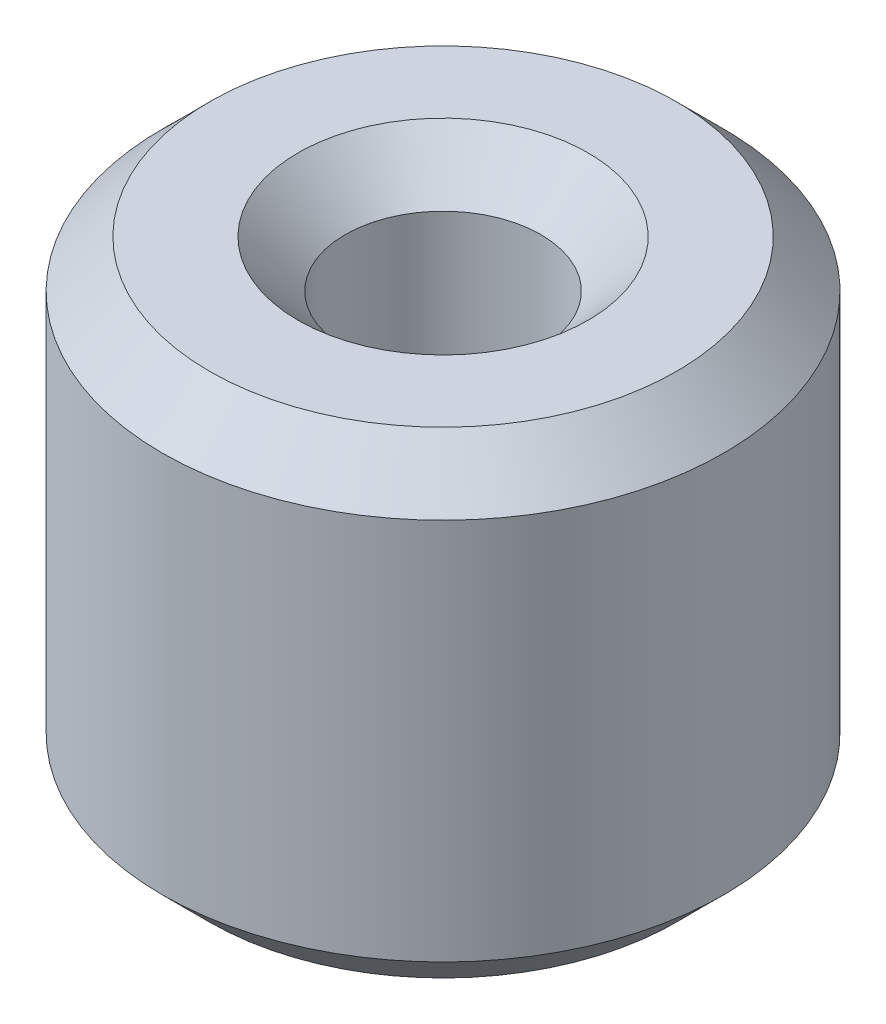
ISO-10303-21;
HEADER;
FILE_DESCRIPTION(('STEP AP214'),'2;1');
FILE_NAME('part.step','',(''),(''),'','','');
FILE_SCHEMA(('AUTOMOTIVE_DESIGN { 1 0 10303 214 1 1 1 1 }'));
ENDSEC;
DATA;
#1=APPLICATION_CONTEXT('core data for automotive mechanical design processes');
#2=APPLICATION_PROTOCOL_DEFINITION('international standard','automotive_design',2000,#1);
#3=PRODUCT_CONTEXT('',#1,'mechanical');
#4=PRODUCT('Part','Part','',(#3));
#5=PRODUCT_RELATED_PRODUCT_CATEGORY('part','',(#4));
#6=PRODUCT_DEFINITION_FORMATION('','',#4);
#7=PRODUCT_DEFINITION_CONTEXT('part definition',#1,'design');
#8=PRODUCT_DEFINITION('design','',#6,#7);
#9=PRODUCT_DEFINITION_SHAPE('','',#8);
#10=(LENGTH_UNIT() NAMED_UNIT(*) SI_UNIT(.MILLI.,.METRE.));
#11=(NAMED_UNIT(*) PLANE_ANGLE_UNIT() SI_UNIT($,.RADIAN.));
#12=(NAMED_UNIT(*) SI_UNIT($,.STERADIAN.) SOLID_ANGLE_UNIT());
#13=UNCERTAINTY_MEASURE_WITH_UNIT(LENGTH_MEASURE(1.E-05),#10,'distance_accuracy_value','');
#14=(GEOMETRIC_REPRESENTATION_CONTEXT(3) GLOBAL_UNCERTAINTY_ASSIGNED_CONTEXT((#13)) GLOBAL_UNIT_ASSIGNED_CONTEXT((#10,
#11,#12)) REPRESENTATION_CONTEXT('',''));
#15=CARTESIAN_POINT('',(0.,0.,0.));
#16=DIRECTION('',(0.,0.,1.));
#17=DIRECTION('',(1.,0.,0.));
#18=AXIS2_PLACEMENT_3D('',#15,#16,#17);
#19=CARTESIAN_POINT('',(0.,21.2412587301982,0.));
#20=DIRECTION('',(0.,-1.,0.));
#21=DIRECTION('',(0.,0.,-1.));
#22=AXIS2_PLACEMENT_3D('',#19,#20,#21);
#23=CYLINDRICAL_SURFACE('',#22,12.5);
#24=CARTESIAN_POINT('',(0.,2.10189315490494,0.));
#25=DIRECTION('',(0.,1.,0.));
#26=DIRECTION('',(0.,0.,1.));
#27=AXIS2_PLACEMENT_3D('',#24,#25,#26);
#28=CIRCLE('',#27,12.5);
#29=CARTESIAN_POINT('',(0.,2.10189315490494,12.5));
#30=VERTEX_POINT('',#29);
#31=EDGE_CURVE('E10',#30,#30,#28,.T.);
#32=ORIENTED_EDGE('',*,*,#31,.T.);
#33=EDGE_LOOP('',(#32));
#34=FACE_BOUND('',#33,.T.);
#35=CARTESIAN_POINT('',(0.,19.1393655752932,0.));
#36=DIRECTION('',(0.,1.,0.));
#37=DIRECTION('',(0.,0.,1.));
#38=AXIS2_PLACEMENT_3D('',#35,#36,#37);
#39=CIRCLE('',#38,12.5);
#40=CARTESIAN_POINT('',(0.,19.1393655752932,12.5));
#41=VERTEX_POINT('',#40);
#42=EDGE_CURVE('E50',#41,#41,#39,.F.);
#43=ORIENTED_EDGE('',*,*,#42,.T.);
#44=EDGE_LOOP('',(#43));
#45=FACE_BOUND('',#44,.T.);
#46=ADVANCED_FACE('F39',(#34,#45),#23,.T.);
#47=CARTESIAN_POINT('',(0.,21.2412587301982,0.));
#48=DIRECTION('',(0.,1.,0.));
#49=DIRECTION('',(0.,0.,1.));
#50=AXIS2_PLACEMENT_3D('',#47,#48,#49);
#51=PLANE('',#50);
#52=CARTESIAN_POINT('',(0.,21.2412587301982,0.));
#53=DIRECTION('',(0.,1.,0.));
#54=DIRECTION('',(0.,0.,1.));
#55=AXIS2_PLACEMENT_3D('',#52,#53,#54);
#56=CIRCLE('',#55,6.45964576572623);
#57=CARTESIAN_POINT('',(0.,21.2412587301982,6.45964576572623));
#58=VERTEX_POINT('',#57);
#59=EDGE_CURVE('E58',#58,#58,#56,.F.);
#60=ORIENTED_EDGE('',*,*,#59,.T.);
#61=EDGE_LOOP('',(#60));
#62=FACE_BOUND('',#61,.T.);
#63=CARTESIAN_POINT('',(0.,21.2412587301982,0.));
#64=DIRECTION('',(0.,1.,0.));
#65=DIRECTION('',(0.,0.,1.));
#66=AXIS2_PLACEMENT_3D('',#63,#64,#65);
#67=CIRCLE('',#66,10.3981068450951);
#68=CARTESIAN_POINT('',(0.,21.2412587301982,10.3981068450951));
#69=VERTEX_POINT('',#68);
#70=EDGE_CURVE('E61',#69,#69,#67,.T.);
#71=ORIENTED_EDGE('',*,*,#70,.T.);
#72=EDGE_LOOP('',(#71));
#73=FACE_BOUND('',#72,.T.);
#74=ADVANCED_FACE('F88',(#62,#73),#51,.T.);
#75=CARTESIAN_POINT('',(0.,0.,0.));
#76=DIRECTION('',(0.,1.,0.));
#77=DIRECTION('',(0.,0.,1.));
#78=AXIS2_PLACEMENT_3D('',#75,#76,#77);
#79=PLANE('',#78);
#80=CARTESIAN_POINT('',(0.,0.,0.));
#81=DIRECTION('',(0.,1.,0.));
#82=DIRECTION('',(0.,0.,1.));
#83=AXIS2_PLACEMENT_3D('',#80,#81,#82);
#84=CIRCLE('',#83,6.45964576572619);
#85=CARTESIAN_POINT('',(0.,0.,6.45964576572619));
#86=VERTEX_POINT('',#85);
#87=EDGE_CURVE('E51',#86,#86,#84,.T.);
#88=ORIENTED_EDGE('',*,*,#87,.T.);
#89=EDGE_LOOP('',(#88));
#90=FACE_BOUND('',#89,.T.);
#91=CARTESIAN_POINT('',(0.,0.,0.));
#92=DIRECTION('',(0.,1.,0.));
#93=DIRECTION('',(0.,0.,1.));
#94=AXIS2_PLACEMENT_3D('',#91,#92,#93);
#95=CIRCLE('',#94,10.398106845095);
#96=CARTESIAN_POINT('',(0.,0.,10.398106845095));
#97=VERTEX_POINT('',#96);
#98=EDGE_CURVE('E54',#97,#97,#95,.F.);
#99=ORIENTED_EDGE('',*,*,#98,.T.);
#100=EDGE_LOOP('',(#99));
#101=FACE_BOUND('',#100,.T.);
#102=ADVANCED_FACE('F83',(#90,#101),#79,.F.);
#103=CARTESIAN_POINT('',(0.,21.2412587301982,0.));
#104=DIRECTION('',(0.,-1.,0.));
#105=DIRECTION('',(0.,0.,-1.));
#106=AXIS2_PLACEMENT_3D('',#103,#104,#105);
#107=CYLINDRICAL_SURFACE('',#106,4.35775261082127);
#108=CARTESIAN_POINT('',(0.,19.1393655752932,0.));
#109=DIRECTION('',(0.,1.,0.));
#110=DIRECTION('',(0.,0.,1.));
#111=AXIS2_PLACEMENT_3D('',#108,#109,#110);
#112=CIRCLE('',#111,4.35775261082127);
#113=CARTESIAN_POINT('',(0.,19.1393655752932,4.35775261082127));
#114=VERTEX_POINT('',#113);
#115=EDGE_CURVE('E67',#114,#114,#112,.T.);
#116=ORIENTED_EDGE('',*,*,#115,.T.);
#117=EDGE_LOOP('',(#116));
#118=FACE_BOUND('',#117,.T.);
#119=CARTESIAN_POINT('',(0.,2.10189315490494,0.));
#120=DIRECTION('',(0.,1.,0.));
#121=DIRECTION('',(0.,0.,1.));
#122=AXIS2_PLACEMENT_3D('',#119,#120,#121);
#123=CIRCLE('',#122,4.35775261082127);
#124=CARTESIAN_POINT('',(0.,2.10189315490494,4.35775261082127));
#125=VERTEX_POINT('',#124);
#126=EDGE_CURVE('E69',#125,#125,#123,.F.);
#127=ORIENTED_EDGE('',*,*,#126,.T.);
#128=EDGE_LOOP('',(#127));
#129=FACE_BOUND('',#128,.T.);
#130=ADVANCED_FACE('F71',(#118,#129),#107,.F.);
#131=CARTESIAN_POINT('',(0.,19.1393655752932,0.));
#132=DIRECTION('',(0.,1.,0.));
#133=DIRECTION('',(0.,0.,1.));
#134=AXIS2_PLACEMENT_3D('',#131,#132,#133);
#135=CONICAL_SURFACE('',#134,4.35775261082127,0.785398163397453);
#136=ORIENTED_EDGE('',*,*,#59,.F.);
#137=EDGE_LOOP('',(#136));
#138=FACE_BOUND('',#137,.T.);
#139=ORIENTED_EDGE('',*,*,#115,.F.);
#140=EDGE_LOOP('',(#139));
#141=FACE_BOUND('',#140,.T.);
#142=ADVANCED_FACE('F77',(#138,#141),#135,.F.);
#143=CARTESIAN_POINT('',(0.,0.,0.));
#144=DIRECTION('',(0.,-1.,0.));
#145=DIRECTION('',(0.,0.,-1.));
#146=AXIS2_PLACEMENT_3D('',#143,#144,#145);
#147=CONICAL_SURFACE('',#146,6.45964576572619,0.785398163397444);
#148=ORIENTED_EDGE('',*,*,#126,.F.);
#149=EDGE_LOOP('',(#148));
#150=FACE_BOUND('',#149,.T.);
#151=ORIENTED_EDGE('',*,*,#87,.F.);
#152=EDGE_LOOP('',(#151));
#153=FACE_BOUND('',#152,.T.);
#154=ADVANCED_FACE('F73',(#150,#153),#147,.F.);
#155=CARTESIAN_POINT('',(0.,2.10189315490494,0.));
#156=DIRECTION('',(0.,1.,0.));
#157=DIRECTION('',(0.,0.,1.));
#158=AXIS2_PLACEMENT_3D('',#155,#156,#157);
#159=CONICAL_SURFACE('',#158,12.5,0.785398163397452);
#160=ORIENTED_EDGE('',*,*,#98,.F.);
#161=EDGE_LOOP('',(#160));
#162=FACE_BOUND('',#161,.T.);
#163=ORIENTED_EDGE('',*,*,#31,.F.);
#164=EDGE_LOOP('',(#163));
#165=FACE_BOUND('',#164,.T.);
#166=ADVANCED_FACE('F76',(#162,#165),#159,.T.);
#167=CARTESIAN_POINT('',(0.,21.2412587301982,0.));
#168=DIRECTION('',(0.,-1.,0.));
#169=DIRECTION('',(0.,0.,-1.));
#170=AXIS2_PLACEMENT_3D('',#167,#168,#169);
#171=CONICAL_SURFACE('',#170,10.3981068450951,0.785398163397443);
#172=ORIENTED_EDGE('',*,*,#42,.F.);
#173=EDGE_LOOP('',(#172));
#174=FACE_BOUND('',#173,.T.);
#175=ORIENTED_EDGE('',*,*,#70,.F.);
#176=EDGE_LOOP('',(#175));
#177=FACE_BOUND('',#176,.T.);
#178=ADVANCED_FACE('F45',(#174,#177),#171,.T.);
#179=CLOSED_SHELL('',(#46,#74,#102,#130,#142,#154,#166,#178));
#180=MANIFOLD_SOLID_BREP('B2',#179);
#181=ADVANCED_BREP_SHAPE_REPRESENTATION('',(#18,#180),#14);
#182=SHAPE_DEFINITION_REPRESENTATION(#9,#181);
ENDSEC;
END-ISO-10303-21;
